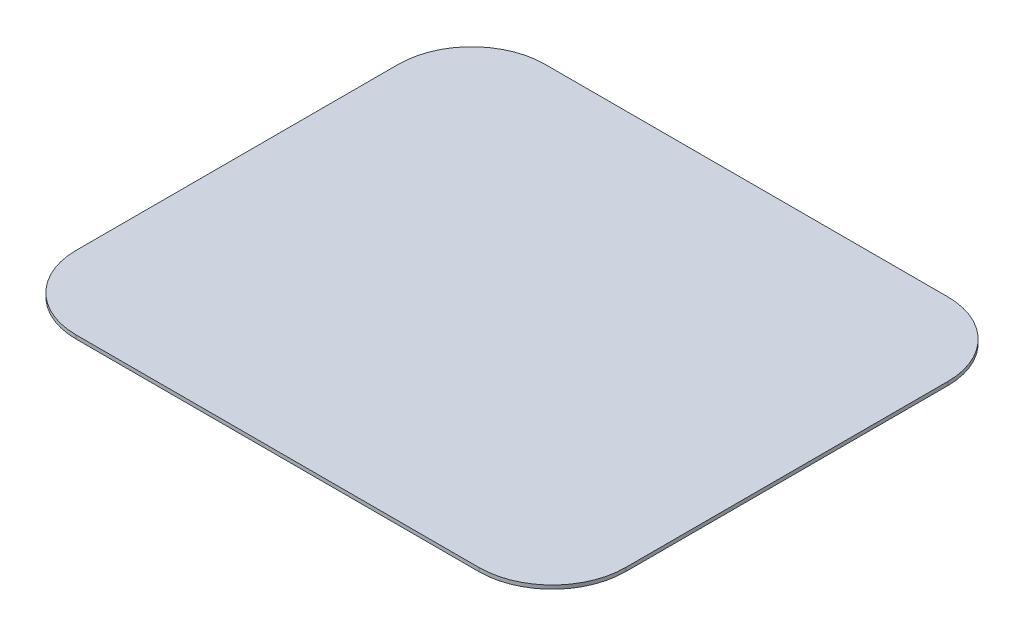
ISO-10303-21;
HEADER;
FILE_DESCRIPTION(('STEP AP214'),'2;1');
FILE_NAME('part.step','',(''),(''),'','','');
FILE_SCHEMA(('AUTOMOTIVE_DESIGN { 1 0 10303 214 1 1 1 1 }'));
ENDSEC;
DATA;
#1=APPLICATION_CONTEXT('core data for automotive mechanical design processes');
#2=APPLICATION_PROTOCOL_DEFINITION('international standard','automotive_design',2000,#1);
#3=PRODUCT_CONTEXT('',#1,'mechanical');
#4=PRODUCT('Part','Part','',(#3));
#5=PRODUCT_RELATED_PRODUCT_CATEGORY('part','',(#4));
#6=PRODUCT_DEFINITION_FORMATION('','',#4);
#7=PRODUCT_DEFINITION_CONTEXT('part definition',#1,'design');
#8=PRODUCT_DEFINITION('design','',#6,#7);
#9=PRODUCT_DEFINITION_SHAPE('','',#8);
#10=(LENGTH_UNIT() NAMED_UNIT(*) SI_UNIT(.MILLI.,.METRE.));
#11=(NAMED_UNIT(*) PLANE_ANGLE_UNIT() SI_UNIT($,.RADIAN.));
#12=(NAMED_UNIT(*) SI_UNIT($,.STERADIAN.) SOLID_ANGLE_UNIT());
#13=UNCERTAINTY_MEASURE_WITH_UNIT(LENGTH_MEASURE(1.E-05),#10,'distance_accuracy_value','');
#14=(GEOMETRIC_REPRESENTATION_CONTEXT(3) GLOBAL_UNCERTAINTY_ASSIGNED_CONTEXT((#13)) GLOBAL_UNIT_ASSIGNED_CONTEXT((#10,
#11,#12)) REPRESENTATION_CONTEXT('',''));
#15=CARTESIAN_POINT('',(0.,0.,0.));
#16=DIRECTION('',(0.,0.,1.));
#17=DIRECTION('',(1.,0.,0.));
#18=AXIS2_PLACEMENT_3D('',#15,#16,#17);
#19=CARTESIAN_POINT('',(127.283018867925,2.,-39.5943396226415));
#20=DIRECTION('',(0.,-1.,0.));
#21=DIRECTION('',(0.,0.,-1.));
#22=AXIS2_PLACEMENT_3D('',#19,#20,#21);
#23=CYLINDRICAL_SURFACE('',#22,40.);
#24=CARTESIAN_POINT('',(127.283018867925,0.,-39.5943396226415));
#25=DIRECTION('',(0.,1.,0.));
#26=DIRECTION('',(0.,0.,-1.));
#27=AXIS2_PLACEMENT_3D('',#24,#25,#26);
#28=CIRCLE('',#27,40.);
#29=CARTESIAN_POINT('',(167.283018867925,0.,-39.5943396226413));
#30=VERTEX_POINT('',#29);
#31=CARTESIAN_POINT('',(127.283018867924,0.,-79.5943396226415));
#32=VERTEX_POINT('',#31);
#33=EDGE_CURVE('E144',#30,#32,#28,.T.);
#34=ORIENTED_EDGE('',*,*,#33,.T.);
#35=DIRECTION('',(0.,-1.,0.));
#36=VECTOR('',#35,1.);
#37=CARTESIAN_POINT('',(127.283018867924,2.,-79.5943396226415));
#38=LINE('',#37,#36);
#39=CARTESIAN_POINT('',(127.283018867924,2.,-79.5943396226415));
#40=VERTEX_POINT('',#39);
#41=EDGE_CURVE('E11',#40,#32,#38,.T.);
#42=ORIENTED_EDGE('',*,*,#41,.F.);
#43=CARTESIAN_POINT('',(127.283018867925,2.,-39.5943396226415));
#44=DIRECTION('',(0.,1.,0.));
#45=DIRECTION('',(0.,0.,-1.));
#46=AXIS2_PLACEMENT_3D('',#43,#44,#45);
#47=CIRCLE('',#46,40.);
#48=CARTESIAN_POINT('',(167.283018867925,2.,-39.5943396226413));
#49=VERTEX_POINT('',#48);
#50=EDGE_CURVE('E166',#49,#40,#47,.T.);
#51=ORIENTED_EDGE('',*,*,#50,.F.);
#52=DIRECTION('',(0.,-1.,0.));
#53=VECTOR('',#52,1.);
#54=CARTESIAN_POINT('',(167.283018867925,2.,-39.5943396226413));
#55=LINE('',#54,#53);
#56=EDGE_CURVE('E140',#49,#30,#55,.T.);
#57=ORIENTED_EDGE('',*,*,#56,.T.);
#58=EDGE_LOOP('',(#34,#42,#51,#57));
#59=FACE_BOUND('',#58,.T.);
#60=ADVANCED_FACE('F43',(#59),#23,.T.);
#61=CARTESIAN_POINT('',(-92.7169811320754,2.,-79.5943396226416));
#62=DIRECTION('',(0.,0.,1.));
#63=DIRECTION('',(1.,0.,0.));
#64=AXIS2_PLACEMENT_3D('',#61,#62,#63);
#65=PLANE('',#64);
#66=DIRECTION('',(-1.,0.,0.));
#67=VECTOR('',#66,1.);
#68=CARTESIAN_POINT('',(-92.7169811320754,0.,-79.5943396226416));
#69=LINE('',#68,#67);
#70=CARTESIAN_POINT('',(-92.7169811320754,0.,-79.5943396226416));
#71=VERTEX_POINT('',#70);
#72=EDGE_CURVE('E148',#32,#71,#69,.T.);
#73=ORIENTED_EDGE('',*,*,#72,.T.);
#74=DIRECTION('',(0.,-1.,0.));
#75=VECTOR('',#74,1.);
#76=CARTESIAN_POINT('',(-92.7169811320754,2.,-79.5943396226416));
#77=LINE('',#76,#75);
#78=CARTESIAN_POINT('',(-92.7169811320754,2.,-79.5943396226416));
#79=VERTEX_POINT('',#78);
#80=EDGE_CURVE('E52',#79,#71,#77,.T.);
#81=ORIENTED_EDGE('',*,*,#80,.F.);
#82=DIRECTION('',(-1.,0.,0.));
#83=VECTOR('',#82,1.);
#84=CARTESIAN_POINT('',(-92.7169811320754,2.,-79.5943396226416));
#85=LINE('',#84,#83);
#86=EDGE_CURVE('E103',#40,#79,#85,.T.);
#87=ORIENTED_EDGE('',*,*,#86,.F.);
#88=ORIENTED_EDGE('',*,*,#41,.T.);
#89=EDGE_LOOP('',(#73,#81,#87,#88));
#90=FACE_BOUND('',#89,.T.);
#91=ADVANCED_FACE('F212',(#90),#65,.F.);
#92=CARTESIAN_POINT('',(-92.7169811320754,2.,-39.5943396226415));
#93=DIRECTION('',(0.,-1.,0.));
#94=DIRECTION('',(0.,0.,-1.));
#95=AXIS2_PLACEMENT_3D('',#92,#93,#94);
#96=CYLINDRICAL_SURFACE('',#95,40.);
#97=CARTESIAN_POINT('',(-92.7169811320754,0.,-39.5943396226415));
#98=DIRECTION('',(0.,1.,0.));
#99=DIRECTION('',(0.,0.,-1.));
#100=AXIS2_PLACEMENT_3D('',#97,#98,#99);
#101=CIRCLE('',#100,40.);
#102=CARTESIAN_POINT('',(-132.716981132075,0.,-39.5943396226415));
#103=VERTEX_POINT('',#102);
#104=EDGE_CURVE('E151',#71,#103,#101,.T.);
#105=ORIENTED_EDGE('',*,*,#104,.T.);
#106=DIRECTION('',(0.,-1.,0.));
#107=VECTOR('',#106,1.);
#108=CARTESIAN_POINT('',(-132.716981132075,2.,-39.5943396226415));
#109=LINE('',#108,#107);
#110=CARTESIAN_POINT('',(-132.716981132075,2.,-39.5943396226415));
#111=VERTEX_POINT('',#110);
#112=EDGE_CURVE('E177',#111,#103,#109,.T.);
#113=ORIENTED_EDGE('',*,*,#112,.F.);
#114=CARTESIAN_POINT('',(-92.7169811320754,2.,-39.5943396226415));
#115=DIRECTION('',(0.,1.,0.));
#116=DIRECTION('',(0.,0.,-1.));
#117=AXIS2_PLACEMENT_3D('',#114,#115,#116);
#118=CIRCLE('',#117,40.);
#119=EDGE_CURVE('E187',#79,#111,#118,.T.);
#120=ORIENTED_EDGE('',*,*,#119,.F.);
#121=ORIENTED_EDGE('',*,*,#80,.T.);
#122=EDGE_LOOP('',(#105,#113,#120,#121));
#123=FACE_BOUND('',#122,.T.);
#124=ADVANCED_FACE('F185',(#123),#96,.T.);
#125=CARTESIAN_POINT('',(-132.716981132075,2.,-39.5943396226415));
#126=DIRECTION('',(1.,0.,0.));
#127=DIRECTION('',(0.,0.,-1.));
#128=AXIS2_PLACEMENT_3D('',#125,#126,#127);
#129=PLANE('',#128);
#130=DIRECTION('',(0.,0.,1.));
#131=VECTOR('',#130,1.);
#132=CARTESIAN_POINT('',(-132.716981132075,0.,-39.5943396226415));
#133=LINE('',#132,#131);
#134=CARTESIAN_POINT('',(-132.716981132075,0.,136.405660377358));
#135=VERTEX_POINT('',#134);
#136=EDGE_CURVE('E154',#103,#135,#133,.T.);
#137=ORIENTED_EDGE('',*,*,#136,.T.);
#138=DIRECTION('',(0.,-1.,0.));
#139=VECTOR('',#138,1.);
#140=CARTESIAN_POINT('',(-132.716981132075,2.,136.405660377358));
#141=LINE('',#140,#139);
#142=CARTESIAN_POINT('',(-132.716981132075,2.,136.405660377358));
#143=VERTEX_POINT('',#142);
#144=EDGE_CURVE('E173',#143,#135,#141,.T.);
#145=ORIENTED_EDGE('',*,*,#144,.F.);
#146=DIRECTION('',(0.,0.,1.));
#147=VECTOR('',#146,1.);
#148=CARTESIAN_POINT('',(-132.716981132075,2.,-39.5943396226415));
#149=LINE('',#148,#147);
#150=EDGE_CURVE('E200',#111,#143,#149,.T.);
#151=ORIENTED_EDGE('',*,*,#150,.F.);
#152=ORIENTED_EDGE('',*,*,#112,.T.);
#153=EDGE_LOOP('',(#137,#145,#151,#152));
#154=FACE_BOUND('',#153,.T.);
#155=ADVANCED_FACE('F195',(#154),#129,.F.);
#156=CARTESIAN_POINT('',(-92.7169811320754,2.,136.405660377358));
#157=DIRECTION('',(0.,-1.,0.));
#158=DIRECTION('',(0.,0.,-1.));
#159=AXIS2_PLACEMENT_3D('',#156,#157,#158);
#160=CYLINDRICAL_SURFACE('',#159,40.);
#161=CARTESIAN_POINT('',(-92.7169811320754,0.,136.405660377358));
#162=DIRECTION('',(0.,1.,0.));
#163=DIRECTION('',(0.,0.,1.));
#164=AXIS2_PLACEMENT_3D('',#161,#162,#163);
#165=CIRCLE('',#164,40.);
#166=CARTESIAN_POINT('',(-92.7169811320754,0.,176.405660377358));
#167=VERTEX_POINT('',#166);
#168=EDGE_CURVE('E157',#135,#167,#165,.T.);
#169=ORIENTED_EDGE('',*,*,#168,.T.);
#170=DIRECTION('',(0.,-1.,0.));
#171=VECTOR('',#170,1.);
#172=CARTESIAN_POINT('',(-92.7169811320754,2.,176.405660377358));
#173=LINE('',#172,#171);
#174=CARTESIAN_POINT('',(-92.7169811320754,2.,176.405660377358));
#175=VERTEX_POINT('',#174);
#176=EDGE_CURVE('E133',#175,#167,#173,.T.);
#177=ORIENTED_EDGE('',*,*,#176,.F.);
#178=CARTESIAN_POINT('',(-92.7169811320754,2.,136.405660377358));
#179=DIRECTION('',(0.,1.,0.));
#180=DIRECTION('',(0.,0.,1.));
#181=AXIS2_PLACEMENT_3D('',#178,#179,#180);
#182=CIRCLE('',#181,40.);
#183=EDGE_CURVE('E122',#143,#175,#182,.T.);
#184=ORIENTED_EDGE('',*,*,#183,.F.);
#185=ORIENTED_EDGE('',*,*,#144,.T.);
#186=EDGE_LOOP('',(#169,#177,#184,#185));
#187=FACE_BOUND('',#186,.T.);
#188=ADVANCED_FACE('F198',(#187),#160,.T.);
#189=CARTESIAN_POINT('',(-92.7169811320754,2.,176.405660377358));
#190=DIRECTION('',(0.,0.,-1.));
#191=DIRECTION('',(-1.,0.,0.));
#192=AXIS2_PLACEMENT_3D('',#189,#190,#191);
#193=PLANE('',#192);
#194=DIRECTION('',(1.,0.,0.));
#195=VECTOR('',#194,1.);
#196=CARTESIAN_POINT('',(-92.7169811320754,0.,176.405660377358));
#197=LINE('',#196,#195);
#198=CARTESIAN_POINT('',(127.283018867925,0.,176.405660377358));
#199=VERTEX_POINT('',#198);
#200=EDGE_CURVE('E131',#167,#199,#197,.T.);
#201=ORIENTED_EDGE('',*,*,#200,.T.);
#202=DIRECTION('',(0.,-1.,0.));
#203=VECTOR('',#202,1.);
#204=CARTESIAN_POINT('',(127.283018867925,2.,176.405660377358));
#205=LINE('',#204,#203);
#206=CARTESIAN_POINT('',(127.283018867925,2.,176.405660377358));
#207=VERTEX_POINT('',#206);
#208=EDGE_CURVE('E128',#207,#199,#205,.T.);
#209=ORIENTED_EDGE('',*,*,#208,.F.);
#210=DIRECTION('',(1.,0.,0.));
#211=VECTOR('',#210,1.);
#212=CARTESIAN_POINT('',(-92.7169811320754,2.,176.405660377358));
#213=LINE('',#212,#211);
#214=EDGE_CURVE('E116',#175,#207,#213,.T.);
#215=ORIENTED_EDGE('',*,*,#214,.F.);
#216=ORIENTED_EDGE('',*,*,#176,.T.);
#217=EDGE_LOOP('',(#201,#209,#215,#216));
#218=FACE_BOUND('',#217,.T.);
#219=ADVANCED_FACE('F129',(#218),#193,.F.);
#220=CARTESIAN_POINT('',(127.283018867925,2.,136.405660377358));
#221=DIRECTION('',(0.,-1.,0.));
#222=DIRECTION('',(0.,0.,-1.));
#223=AXIS2_PLACEMENT_3D('',#220,#221,#222);
#224=CYLINDRICAL_SURFACE('',#223,40.);
#225=CARTESIAN_POINT('',(127.283018867925,0.,136.405660377358));
#226=DIRECTION('',(0.,1.,0.));
#227=DIRECTION('',(0.,0.,1.));
#228=AXIS2_PLACEMENT_3D('',#225,#226,#227);
#229=CIRCLE('',#228,40.);
#230=CARTESIAN_POINT('',(167.283018867925,0.,136.405660377358));
#231=VERTEX_POINT('',#230);
#232=EDGE_CURVE('E89',#199,#231,#229,.T.);
#233=ORIENTED_EDGE('',*,*,#232,.T.);
#234=DIRECTION('',(0.,-1.,0.));
#235=VECTOR('',#234,1.);
#236=CARTESIAN_POINT('',(167.283018867925,2.,136.405660377358));
#237=LINE('',#236,#235);
#238=CARTESIAN_POINT('',(167.283018867925,2.,136.405660377358));
#239=VERTEX_POINT('',#238);
#240=EDGE_CURVE('E134',#239,#231,#237,.T.);
#241=ORIENTED_EDGE('',*,*,#240,.F.);
#242=CARTESIAN_POINT('',(127.283018867925,2.,136.405660377358));
#243=DIRECTION('',(0.,1.,0.));
#244=DIRECTION('',(0.,0.,1.));
#245=AXIS2_PLACEMENT_3D('',#242,#243,#244);
#246=CIRCLE('',#245,40.);
#247=EDGE_CURVE('E120',#207,#239,#246,.T.);
#248=ORIENTED_EDGE('',*,*,#247,.F.);
#249=ORIENTED_EDGE('',*,*,#208,.T.);
#250=EDGE_LOOP('',(#233,#241,#248,#249));
#251=FACE_BOUND('',#250,.T.);
#252=ADVANCED_FACE('F136',(#251),#224,.T.);
#253=CARTESIAN_POINT('',(167.283018867925,2.,-39.5943396226413));
#254=DIRECTION('',(-1.,0.,0.));
#255=DIRECTION('',(0.,0.,1.));
#256=AXIS2_PLACEMENT_3D('',#253,#254,#255);
#257=PLANE('',#256);
#258=DIRECTION('',(0.,0.,-1.));
#259=VECTOR('',#258,1.);
#260=CARTESIAN_POINT('',(167.283018867925,0.,-39.5943396226413));
#261=LINE('',#260,#259);
#262=EDGE_CURVE('E95',#231,#30,#261,.T.);
#263=ORIENTED_EDGE('',*,*,#262,.T.);
#264=ORIENTED_EDGE('',*,*,#56,.F.);
#265=DIRECTION('',(0.,0.,-1.));
#266=VECTOR('',#265,1.);
#267=CARTESIAN_POINT('',(167.283018867925,2.,-39.5943396226413));
#268=LINE('',#267,#266);
#269=EDGE_CURVE('E60',#239,#49,#268,.T.);
#270=ORIENTED_EDGE('',*,*,#269,.F.);
#271=ORIENTED_EDGE('',*,*,#240,.T.);
#272=EDGE_LOOP('',(#263,#264,#270,#271));
#273=FACE_BOUND('',#272,.T.);
#274=ADVANCED_FACE('F228',(#273),#257,.F.);
#275=CARTESIAN_POINT('',(127.283018867925,2.,-39.5943396226415));
#276=DIRECTION('',(0.,-1.,0.));
#277=DIRECTION('',(0.,0.,-1.));
#278=AXIS2_PLACEMENT_3D('',#275,#276,#277);
#279=PLANE('',#278);
#280=ORIENTED_EDGE('',*,*,#50,.T.);
#281=ORIENTED_EDGE('',*,*,#86,.T.);
#282=ORIENTED_EDGE('',*,*,#119,.T.);
#283=ORIENTED_EDGE('',*,*,#150,.T.);
#284=ORIENTED_EDGE('',*,*,#183,.T.);
#285=ORIENTED_EDGE('',*,*,#214,.T.);
#286=ORIENTED_EDGE('',*,*,#247,.T.);
#287=ORIENTED_EDGE('',*,*,#269,.T.);
#288=EDGE_LOOP('',(#280,#281,#282,#283,#284,#285,#286,#287));
#289=FACE_BOUND('',#288,.T.);
#290=ADVANCED_FACE('F118',(#289),#279,.F.);
#291=CARTESIAN_POINT('',(127.283018867925,0.,-39.5943396226415));
#292=DIRECTION('',(0.,-1.,0.));
#293=DIRECTION('',(0.,0.,-1.));
#294=AXIS2_PLACEMENT_3D('',#291,#292,#293);
#295=PLANE('',#294);
#296=ORIENTED_EDGE('',*,*,#33,.F.);
#297=ORIENTED_EDGE('',*,*,#262,.F.);
#298=ORIENTED_EDGE('',*,*,#232,.F.);
#299=ORIENTED_EDGE('',*,*,#200,.F.);
#300=ORIENTED_EDGE('',*,*,#168,.F.);
#301=ORIENTED_EDGE('',*,*,#136,.F.);
#302=ORIENTED_EDGE('',*,*,#104,.F.);
#303=ORIENTED_EDGE('',*,*,#72,.F.);
#304=EDGE_LOOP('',(#296,#297,#298,#299,#300,#301,#302,#303));
#305=FACE_BOUND('',#304,.T.);
#306=ADVANCED_FACE('F191',(#305),#295,.T.);
#307=CLOSED_SHELL('',(#60,#91,#124,#155,#188,#219,#252,#274,#290,#306));
#308=MANIFOLD_SOLID_BREP('B2',#307);
#309=ADVANCED_BREP_SHAPE_REPRESENTATION('',(#18,#308),#14);
#310=SHAPE_DEFINITION_REPRESENTATION(#9,#309);
ENDSEC;
END-ISO-10303-21;
